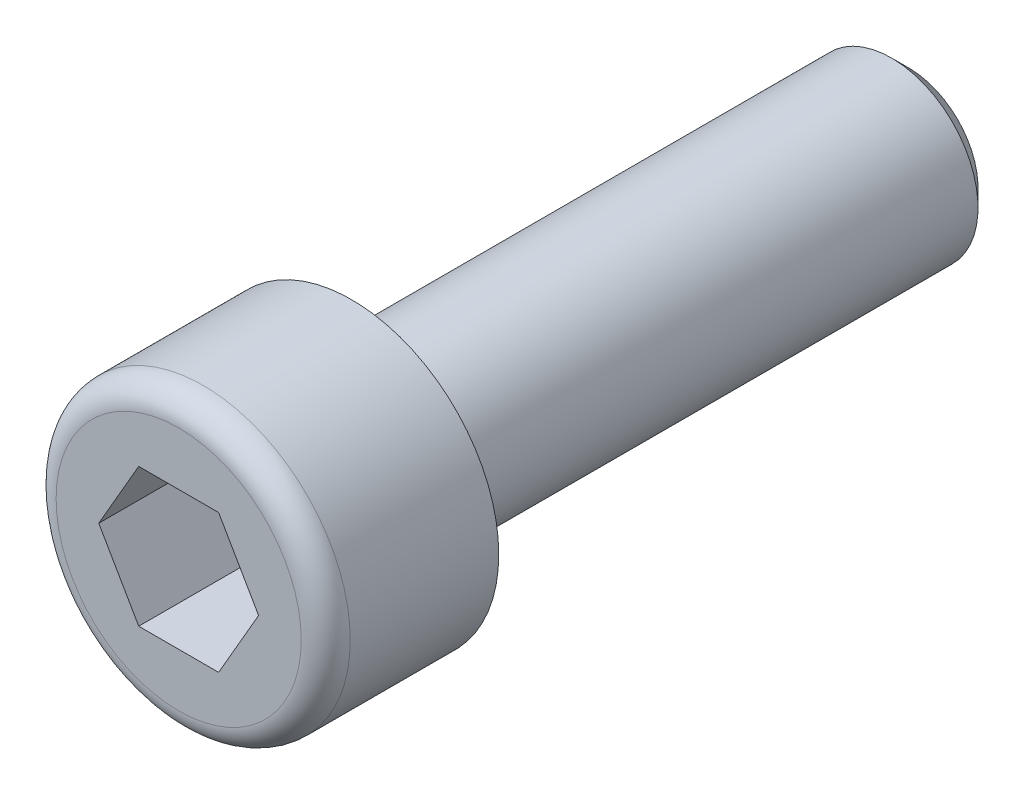
ISO-10303-21;
HEADER;
FILE_DESCRIPTION(('STEP AP214'),'2;1');
FILE_NAME('part.step','',(''),(''),'','','');
FILE_SCHEMA(('AUTOMOTIVE_DESIGN { 1 0 10303 214 1 1 1 1 }'));
ENDSEC;
DATA;
#1=APPLICATION_CONTEXT('core data for automotive mechanical design processes');
#2=APPLICATION_PROTOCOL_DEFINITION('international standard','automotive_design',2000,#1);
#3=PRODUCT_CONTEXT('',#1,'mechanical');
#4=PRODUCT('Part','Part','',(#3));
#5=PRODUCT_RELATED_PRODUCT_CATEGORY('part','',(#4));
#6=PRODUCT_DEFINITION_FORMATION('','',#4);
#7=PRODUCT_DEFINITION_CONTEXT('part definition',#1,'design');
#8=PRODUCT_DEFINITION('design','',#6,#7);
#9=PRODUCT_DEFINITION_SHAPE('','',#8);
#10=(LENGTH_UNIT() NAMED_UNIT(*) SI_UNIT(.MILLI.,.METRE.));
#11=(NAMED_UNIT(*) PLANE_ANGLE_UNIT() SI_UNIT($,.RADIAN.));
#12=(NAMED_UNIT(*) SI_UNIT($,.STERADIAN.) SOLID_ANGLE_UNIT());
#13=UNCERTAINTY_MEASURE_WITH_UNIT(LENGTH_MEASURE(1.E-05),#10,'distance_accuracy_value','');
#14=(GEOMETRIC_REPRESENTATION_CONTEXT(3) GLOBAL_UNCERTAINTY_ASSIGNED_CONTEXT((#13)) GLOBAL_UNIT_ASSIGNED_CONTEXT((#10,
#11,#12)) REPRESENTATION_CONTEXT('',''));
#15=CARTESIAN_POINT('',(0.,0.,0.));
#16=DIRECTION('',(0.,0.,1.));
#17=DIRECTION('',(1.,0.,0.));
#18=AXIS2_PLACEMENT_3D('',#15,#16,#17);
#19=CARTESIAN_POINT('',(0.,0.,5.));
#20=DIRECTION('',(0.,0.,-1.));
#21=DIRECTION('',(-1.,0.,0.));
#22=AXIS2_PLACEMENT_3D('',#19,#20,#21);
#23=CYLINDRICAL_SURFACE('',#22,4.25);
#24=CARTESIAN_POINT('',(0.,0.,4.29166666666667));
#25=DIRECTION('',(0.,0.,1.));
#26=DIRECTION('',(1.,0.,0.));
#27=AXIS2_PLACEMENT_3D('',#24,#25,#26);
#28=CIRCLE('',#27,4.25);
#29=CARTESIAN_POINT('',(4.25,0.,4.29166666666667));
#30=VERTEX_POINT('',#29);
#31=EDGE_CURVE('E11',#30,#30,#28,.F.);
#32=ORIENTED_EDGE('',*,*,#31,.T.);
#33=EDGE_LOOP('',(#32));
#34=FACE_BOUND('',#33,.T.);
#35=CARTESIAN_POINT('',(0.,0.,0.));
#36=DIRECTION('',(0.,0.,1.));
#37=DIRECTION('',(1.,0.,0.));
#38=AXIS2_PLACEMENT_3D('',#35,#36,#37);
#39=CIRCLE('',#38,4.25);
#40=CARTESIAN_POINT('',(4.25,0.,0.));
#41=VERTEX_POINT('',#40);
#42=EDGE_CURVE('E150',#41,#41,#39,.T.);
#43=ORIENTED_EDGE('',*,*,#42,.T.);
#44=EDGE_LOOP('',(#43));
#45=FACE_BOUND('',#44,.T.);
#46=ADVANCED_FACE('F42',(#34,#45),#23,.T.);
#47=CARTESIAN_POINT('',(0.,0.,5.));
#48=DIRECTION('',(0.,0.,1.));
#49=DIRECTION('',(1.,0.,0.));
#50=AXIS2_PLACEMENT_3D('',#47,#48,#49);
#51=PLANE('',#50);
#52=CARTESIAN_POINT('',(0.,0.,5.));
#53=DIRECTION('',(0.,0.,1.));
#54=DIRECTION('',(1.,0.,0.));
#55=AXIS2_PLACEMENT_3D('',#52,#53,#54);
#56=CIRCLE('',#55,3.54166666666667);
#57=CARTESIAN_POINT('',(3.54166666666667,0.,5.));
#58=VERTEX_POINT('',#57);
#59=EDGE_CURVE('E50',#58,#58,#56,.T.);
#60=ORIENTED_EDGE('',*,*,#59,.T.);
#61=EDGE_LOOP('',(#60));
#62=FACE_BOUND('',#61,.T.);
#63=DIRECTION('',(0.500000000000001,0.866025403784438,0.));
#64=VECTOR('',#63,1.);
#65=CARTESIAN_POINT('',(1.15470053837925,-2.,5.));
#66=LINE('',#65,#64);
#67=CARTESIAN_POINT('',(1.15470053837925,-2.,5.));
#68=VERTEX_POINT('',#67);
#69=CARTESIAN_POINT('',(2.30940107675851,0.,5.));
#70=VERTEX_POINT('',#69);
#71=EDGE_CURVE('E57',#68,#70,#66,.T.);
#72=ORIENTED_EDGE('',*,*,#71,.F.);
#73=DIRECTION('',(1.,0.,0.));
#74=VECTOR('',#73,1.);
#75=CARTESIAN_POINT('',(-1.15470053837925,-2.,5.));
#76=LINE('',#75,#74);
#77=CARTESIAN_POINT('',(-1.15470053837925,-2.,5.));
#78=VERTEX_POINT('',#77);
#79=EDGE_CURVE('E140',#78,#68,#76,.T.);
#80=ORIENTED_EDGE('',*,*,#79,.F.);
#81=DIRECTION('',(0.500000000000001,-0.866025403784438,0.));
#82=VECTOR('',#81,1.);
#83=CARTESIAN_POINT('',(-2.30940107675851,0.,5.));
#84=LINE('',#83,#82);
#85=CARTESIAN_POINT('',(-2.30940107675851,0.,5.));
#86=VERTEX_POINT('',#85);
#87=EDGE_CURVE('E138',#86,#78,#84,.T.);
#88=ORIENTED_EDGE('',*,*,#87,.F.);
#89=DIRECTION('',(-0.500000000000001,-0.866025403784438,0.));
#90=VECTOR('',#89,1.);
#91=CARTESIAN_POINT('',(-1.15470053837925,2.,5.));
#92=LINE('',#91,#90);
#93=CARTESIAN_POINT('',(-1.15470053837925,2.,5.));
#94=VERTEX_POINT('',#93);
#95=EDGE_CURVE('E105',#94,#86,#92,.T.);
#96=ORIENTED_EDGE('',*,*,#95,.F.);
#97=DIRECTION('',(-1.,0.,0.));
#98=VECTOR('',#97,1.);
#99=CARTESIAN_POINT('',(1.15470053837925,2.,5.));
#100=LINE('',#99,#98);
#101=CARTESIAN_POINT('',(1.15470053837925,2.,5.));
#102=VERTEX_POINT('',#101);
#103=EDGE_CURVE('E134',#102,#94,#100,.T.);
#104=ORIENTED_EDGE('',*,*,#103,.F.);
#105=DIRECTION('',(-0.500000000000002,0.866025403784438,0.));
#106=VECTOR('',#105,1.);
#107=CARTESIAN_POINT('',(2.30940107675851,0.,5.));
#108=LINE('',#107,#106);
#109=EDGE_CURVE('E131',#70,#102,#108,.T.);
#110=ORIENTED_EDGE('',*,*,#109,.F.);
#111=EDGE_LOOP('',(#72,#80,#88,#96,#104,#110));
#112=FACE_BOUND('',#111,.T.);
#113=ADVANCED_FACE('F179',(#62,#112),#51,.T.);
#114=CARTESIAN_POINT('',(0.,0.,0.));
#115=DIRECTION('',(0.,0.,1.));
#116=DIRECTION('',(1.,0.,0.));
#117=AXIS2_PLACEMENT_3D('',#114,#115,#116);
#118=PLANE('',#117);
#119=CARTESIAN_POINT('',(0.,0.,0.));
#120=DIRECTION('',(0.,0.,1.));
#121=DIRECTION('',(1.,0.,0.));
#122=AXIS2_PLACEMENT_3D('',#119,#120,#121);
#123=CIRCLE('',#122,2.5);
#124=CARTESIAN_POINT('',(2.5,0.,0.));
#125=VERTEX_POINT('',#124);
#126=EDGE_CURVE('E153',#125,#125,#123,.F.);
#127=ORIENTED_EDGE('',*,*,#126,.F.);
#128=EDGE_LOOP('',(#127));
#129=FACE_BOUND('',#128,.T.);
#130=ORIENTED_EDGE('',*,*,#42,.F.);
#131=EDGE_LOOP('',(#130));
#132=FACE_BOUND('',#131,.T.);
#133=ADVANCED_FACE('F177',(#129,#132),#118,.F.);
#134=CARTESIAN_POINT('',(0.,0.,-0.1));
#135=DIRECTION('',(0.,0.,1.));
#136=DIRECTION('',(1.,0.,0.));
#137=AXIS2_PLACEMENT_3D('',#134,#135,#136);
#138=CYLINDRICAL_SURFACE('',#137,2.5);
#139=CARTESIAN_POINT('',(0.,0.,-0.0999999999999994));
#140=DIRECTION('',(0.,0.,-1.));
#141=DIRECTION('',(-1.,0.,0.));
#142=AXIS2_PLACEMENT_3D('',#139,#140,#141);
#143=CIRCLE('',#142,2.49975);
#144=CARTESIAN_POINT('',(-2.49975,0.,-0.0999999999999994));
#145=VERTEX_POINT('',#144);
#146=EDGE_CURVE('E144',#145,#145,#143,.T.);
#147=ORIENTED_EDGE('',*,*,#146,.F.);
#148=EDGE_LOOP('',(#147));
#149=FACE_BOUND('',#148,.T.);
#150=ORIENTED_EDGE('',*,*,#126,.T.);
#151=EDGE_LOOP('',(#150));
#152=FACE_BOUND('',#151,.T.);
#153=ADVANCED_FACE('F166',(#149,#152),#138,.T.);
#154=CARTESIAN_POINT('',(1.15470053837925,-2.,0.));
#155=DIRECTION('',(0.866025403784438,-0.500000000000001,0.));
#156=DIRECTION('',(0.500000000000001,0.866025403784438,0.));
#157=AXIS2_PLACEMENT_3D('',#154,#155,#156);
#158=PLANE('',#157);
#159=ORIENTED_EDGE('',*,*,#71,.T.);
#160=DIRECTION('',(0.,0.,1.));
#161=VECTOR('',#160,1.);
#162=CARTESIAN_POINT('',(2.30940107675851,0.,0.));
#163=LINE('',#162,#161);
#164=CARTESIAN_POINT('',(2.30940107675851,0.,0.));
#165=VERTEX_POINT('',#164);
#166=EDGE_CURVE('E87',#165,#70,#163,.T.);
#167=ORIENTED_EDGE('',*,*,#166,.F.);
#168=DIRECTION('',(0.500000000000001,0.866025403784438,0.));
#169=VECTOR('',#168,1.);
#170=CARTESIAN_POINT('',(1.15470053837925,-2.,0.));
#171=LINE('',#170,#169);
#172=CARTESIAN_POINT('',(1.15470053837925,-2.,0.));
#173=VERTEX_POINT('',#172);
#174=EDGE_CURVE('E142',#173,#165,#171,.T.);
#175=ORIENTED_EDGE('',*,*,#174,.F.);
#176=DIRECTION('',(0.,0.,1.));
#177=VECTOR('',#176,1.);
#178=CARTESIAN_POINT('',(1.15470053837925,-2.,0.));
#179=LINE('',#178,#177);
#180=EDGE_CURVE('E65',#173,#68,#179,.T.);
#181=ORIENTED_EDGE('',*,*,#180,.T.);
#182=EDGE_LOOP('',(#159,#167,#175,#181));
#183=FACE_BOUND('',#182,.T.);
#184=ADVANCED_FACE('F176',(#183),#158,.F.);
#185=CARTESIAN_POINT('',(-1.15470053837925,-2.,0.));
#186=DIRECTION('',(0.,-1.,0.));
#187=DIRECTION('',(0.,0.,-1.));
#188=AXIS2_PLACEMENT_3D('',#185,#186,#187);
#189=PLANE('',#188);
#190=ORIENTED_EDGE('',*,*,#79,.T.);
#191=ORIENTED_EDGE('',*,*,#180,.F.);
#192=DIRECTION('',(1.,0.,0.));
#193=VECTOR('',#192,1.);
#194=CARTESIAN_POINT('',(-1.15470053837925,-2.,0.));
#195=LINE('',#194,#193);
#196=CARTESIAN_POINT('',(-1.15470053837925,-2.,0.));
#197=VERTEX_POINT('',#196);
#198=EDGE_CURVE('E117',#197,#173,#195,.T.);
#199=ORIENTED_EDGE('',*,*,#198,.F.);
#200=DIRECTION('',(0.,0.,1.));
#201=VECTOR('',#200,1.);
#202=CARTESIAN_POINT('',(-1.15470053837925,-2.,0.));
#203=LINE('',#202,#201);
#204=EDGE_CURVE('E109',#197,#78,#203,.T.);
#205=ORIENTED_EDGE('',*,*,#204,.T.);
#206=EDGE_LOOP('',(#190,#191,#199,#205));
#207=FACE_BOUND('',#206,.T.);
#208=ADVANCED_FACE('F232',(#207),#189,.F.);
#209=CARTESIAN_POINT('',(-2.30940107675851,0.,0.));
#210=DIRECTION('',(-0.866025403784438,-0.500000000000001,0.));
#211=DIRECTION('',(0.500000000000001,-0.866025403784438,0.));
#212=AXIS2_PLACEMENT_3D('',#209,#210,#211);
#213=PLANE('',#212);
#214=ORIENTED_EDGE('',*,*,#87,.T.);
#215=ORIENTED_EDGE('',*,*,#204,.F.);
#216=DIRECTION('',(0.500000000000001,-0.866025403784438,0.));
#217=VECTOR('',#216,1.);
#218=CARTESIAN_POINT('',(-2.30940107675851,0.,0.));
#219=LINE('',#218,#217);
#220=CARTESIAN_POINT('',(-2.30940107675851,0.,0.));
#221=VERTEX_POINT('',#220);
#222=EDGE_CURVE('E113',#221,#197,#219,.T.);
#223=ORIENTED_EDGE('',*,*,#222,.F.);
#224=DIRECTION('',(0.,0.,1.));
#225=VECTOR('',#224,1.);
#226=CARTESIAN_POINT('',(-2.30940107675851,0.,0.));
#227=LINE('',#226,#225);
#228=EDGE_CURVE('E98',#221,#86,#227,.T.);
#229=ORIENTED_EDGE('',*,*,#228,.T.);
#230=EDGE_LOOP('',(#214,#215,#223,#229));
#231=FACE_BOUND('',#230,.T.);
#232=ADVANCED_FACE('F114',(#231),#213,.F.);
#233=CARTESIAN_POINT('',(-1.15470053837925,2.,0.));
#234=DIRECTION('',(-0.866025403784438,0.500000000000001,0.));
#235=DIRECTION('',(-0.500000000000001,-0.866025403784438,0.));
#236=AXIS2_PLACEMENT_3D('',#233,#234,#235);
#237=PLANE('',#236);
#238=ORIENTED_EDGE('',*,*,#95,.T.);
#239=ORIENTED_EDGE('',*,*,#228,.F.);
#240=DIRECTION('',(-0.500000000000001,-0.866025403784438,0.));
#241=VECTOR('',#240,1.);
#242=CARTESIAN_POINT('',(-1.15470053837925,2.,0.));
#243=LINE('',#242,#241);
#244=CARTESIAN_POINT('',(-1.15470053837925,2.,0.));
#245=VERTEX_POINT('',#244);
#246=EDGE_CURVE('E102',#245,#221,#243,.T.);
#247=ORIENTED_EDGE('',*,*,#246,.F.);
#248=DIRECTION('',(0.,0.,1.));
#249=VECTOR('',#248,1.);
#250=CARTESIAN_POINT('',(-1.15470053837925,2.,0.));
#251=LINE('',#250,#249);
#252=EDGE_CURVE('E110',#245,#94,#251,.T.);
#253=ORIENTED_EDGE('',*,*,#252,.T.);
#254=EDGE_LOOP('',(#238,#239,#247,#253));
#255=FACE_BOUND('',#254,.T.);
#256=ADVANCED_FACE('F100',(#255),#237,.F.);
#257=CARTESIAN_POINT('',(1.15470053837925,2.,0.));
#258=DIRECTION('',(0.,1.,0.));
#259=DIRECTION('',(-1.,0.,0.));
#260=AXIS2_PLACEMENT_3D('',#257,#258,#259);
#261=PLANE('',#260);
#262=ORIENTED_EDGE('',*,*,#103,.T.);
#263=ORIENTED_EDGE('',*,*,#252,.F.);
#264=DIRECTION('',(-1.,0.,0.));
#265=VECTOR('',#264,1.);
#266=CARTESIAN_POINT('',(1.15470053837925,2.,0.));
#267=LINE('',#266,#265);
#268=CARTESIAN_POINT('',(1.15470053837925,2.,0.));
#269=VERTEX_POINT('',#268);
#270=EDGE_CURVE('E123',#269,#245,#267,.T.);
#271=ORIENTED_EDGE('',*,*,#270,.F.);
#272=DIRECTION('',(0.,0.,1.));
#273=VECTOR('',#272,1.);
#274=CARTESIAN_POINT('',(1.15470053837925,2.,0.));
#275=LINE('',#274,#273);
#276=EDGE_CURVE('E147',#269,#102,#275,.T.);
#277=ORIENTED_EDGE('',*,*,#276,.T.);
#278=EDGE_LOOP('',(#262,#263,#271,#277));
#279=FACE_BOUND('',#278,.T.);
#280=ADVANCED_FACE('F239',(#279),#261,.F.);
#281=CARTESIAN_POINT('',(2.30940107675851,0.,0.));
#282=DIRECTION('',(0.866025403784438,0.500000000000002,0.));
#283=DIRECTION('',(-0.500000000000002,0.866025403784438,0.));
#284=AXIS2_PLACEMENT_3D('',#281,#282,#283);
#285=PLANE('',#284);
#286=ORIENTED_EDGE('',*,*,#109,.T.);
#287=ORIENTED_EDGE('',*,*,#276,.F.);
#288=DIRECTION('',(-0.500000000000002,0.866025403784438,0.));
#289=VECTOR('',#288,1.);
#290=CARTESIAN_POINT('',(2.30940107675851,0.,0.));
#291=LINE('',#290,#289);
#292=EDGE_CURVE('E125',#165,#269,#291,.T.);
#293=ORIENTED_EDGE('',*,*,#292,.F.);
#294=ORIENTED_EDGE('',*,*,#166,.T.);
#295=EDGE_LOOP('',(#286,#287,#293,#294));
#296=FACE_BOUND('',#295,.T.);
#297=ADVANCED_FACE('F215',(#296),#285,.F.);
#298=CARTESIAN_POINT('',(2.30940107675851,0.,0.));
#299=DIRECTION('',(0.,0.,1.));
#300=DIRECTION('',(1.,0.,0.));
#301=AXIS2_PLACEMENT_3D('',#298,#299,#300);
#302=PLANE('',#301);
#303=ORIENTED_EDGE('',*,*,#174,.T.);
#304=ORIENTED_EDGE('',*,*,#292,.T.);
#305=ORIENTED_EDGE('',*,*,#270,.T.);
#306=ORIENTED_EDGE('',*,*,#246,.T.);
#307=ORIENTED_EDGE('',*,*,#222,.T.);
#308=ORIENTED_EDGE('',*,*,#198,.T.);
#309=EDGE_LOOP('',(#303,#304,#305,#306,#307,#308));
#310=FACE_BOUND('',#309,.T.);
#311=ADVANCED_FACE('F120',(#310),#302,.T.);
#312=CARTESIAN_POINT('',(0.,0.,-16.1));
#313=DIRECTION('',(0.,0.,1.));
#314=DIRECTION('',(1.,0.,0.));
#315=AXIS2_PLACEMENT_3D('',#312,#313,#314);
#316=CYLINDRICAL_SURFACE('',#315,2.49975);
#317=CARTESIAN_POINT('',(0.,0.,-15.60005));
#318=DIRECTION('',(0.,0.,-1.));
#319=DIRECTION('',(-1.,0.,0.));
#320=AXIS2_PLACEMENT_3D('',#317,#318,#319);
#321=CIRCLE('',#320,2.49975);
#322=CARTESIAN_POINT('',(-2.49975,0.,-15.60005));
#323=VERTEX_POINT('',#322);
#324=EDGE_CURVE('E203',#323,#323,#321,.F.);
#325=ORIENTED_EDGE('',*,*,#324,.T.);
#326=EDGE_LOOP('',(#325));
#327=FACE_BOUND('',#326,.T.);
#328=ORIENTED_EDGE('',*,*,#146,.T.);
#329=EDGE_LOOP('',(#328));
#330=FACE_BOUND('',#329,.T.);
#331=ADVANCED_FACE('F197',(#327,#330),#316,.T.);
#332=CARTESIAN_POINT('',(0.,0.,-16.1));
#333=DIRECTION('',(0.,0.,-1.));
#334=DIRECTION('',(-1.,0.,0.));
#335=AXIS2_PLACEMENT_3D('',#332,#333,#334);
#336=PLANE('',#335);
#337=CARTESIAN_POINT('',(0.,0.,-16.1));
#338=DIRECTION('',(0.,0.,-1.));
#339=DIRECTION('',(-1.,0.,0.));
#340=AXIS2_PLACEMENT_3D('',#337,#338,#339);
#341=CIRCLE('',#340,1.99979999999999);
#342=CARTESIAN_POINT('',(-1.99979999999999,0.,-16.1));
#343=VERTEX_POINT('',#342);
#344=EDGE_CURVE('E156',#343,#343,#341,.T.);
#345=ORIENTED_EDGE('',*,*,#344,.T.);
#346=EDGE_LOOP('',(#345));
#347=FACE_BOUND('',#346,.T.);
#348=ADVANCED_FACE('F190',(#347),#336,.T.);
#349=CARTESIAN_POINT('',(0.,0.,-16.1));
#350=DIRECTION('',(0.,0.,1.));
#351=DIRECTION('',(1.,0.,0.));
#352=AXIS2_PLACEMENT_3D('',#349,#350,#351);
#353=CONICAL_SURFACE('',#352,1.99979999999999,0.785398163397453);
#354=ORIENTED_EDGE('',*,*,#324,.F.);
#355=EDGE_LOOP('',(#354));
#356=FACE_BOUND('',#355,.T.);
#357=ORIENTED_EDGE('',*,*,#344,.F.);
#358=EDGE_LOOP('',(#357));
#359=FACE_BOUND('',#358,.T.);
#360=ADVANCED_FACE('F188',(#356,#359),#353,.T.);
#361=CARTESIAN_POINT('',(0.,0.,4.29166666666667));
#362=DIRECTION('',(0.,0.,1.));
#363=DIRECTION('',(1.,0.,0.));
#364=AXIS2_PLACEMENT_3D('',#361,#362,#363);
#365=TOROIDAL_SURFACE('',#364,3.54166666666667,0.708333333333333);
#366=ORIENTED_EDGE('',*,*,#31,.F.);
#367=EDGE_LOOP('',(#366));
#368=FACE_BOUND('',#367,.T.);
#369=ORIENTED_EDGE('',*,*,#59,.F.);
#370=EDGE_LOOP('',(#369));
#371=FACE_BOUND('',#370,.T.);
#372=ADVANCED_FACE('F44',(#368,#371),#365,.T.);
#373=CLOSED_SHELL('',(#46,#113,#133,#153,#184,#208,#232,#256,#280,#297,#311,#331,#348,#360,#372));
#374=MANIFOLD_SOLID_BREP('B2',#373);
#375=ADVANCED_BREP_SHAPE_REPRESENTATION('',(#18,#374),#14);
#376=SHAPE_DEFINITION_REPRESENTATION(#9,#375);
ENDSEC;
END-ISO-10303-21;
